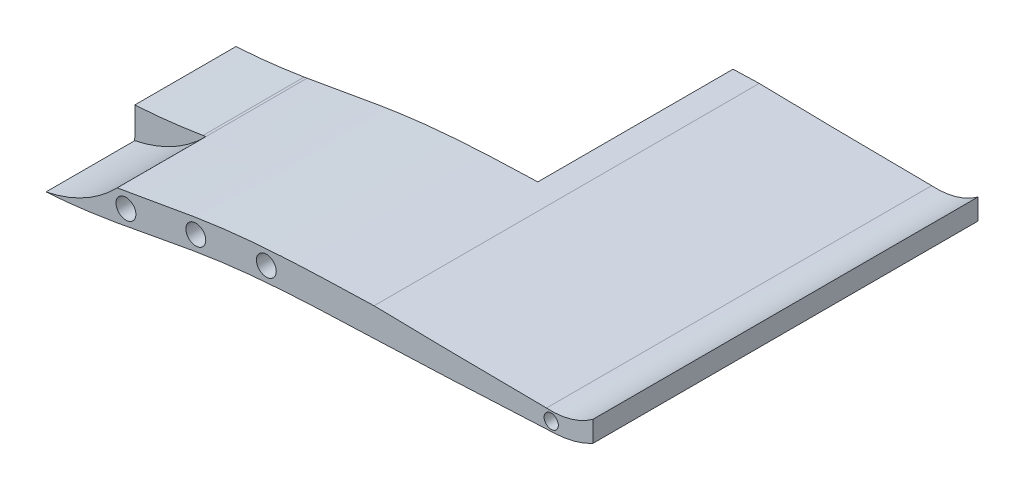
ISO-10303-21;
HEADER;
FILE_DESCRIPTION(('STEP AP214'),'2;1');
FILE_NAME('part.step','',(''),(''),'','','');
FILE_SCHEMA(('AUTOMOTIVE_DESIGN { 1 0 10303 214 1 1 1 1 }'));
ENDSEC;
DATA;
#1=APPLICATION_CONTEXT('core data for automotive mechanical design processes');
#2=APPLICATION_PROTOCOL_DEFINITION('international standard','automotive_design',2000,#1);
#3=PRODUCT_CONTEXT('',#1,'mechanical');
#4=PRODUCT('Part','Part','',(#3));
#5=PRODUCT_RELATED_PRODUCT_CATEGORY('part','',(#4));
#6=PRODUCT_DEFINITION_FORMATION('','',#4);
#7=PRODUCT_DEFINITION_CONTEXT('part definition',#1,'design');
#8=PRODUCT_DEFINITION('design','',#6,#7);
#9=PRODUCT_DEFINITION_SHAPE('','',#8);
#10=(LENGTH_UNIT() NAMED_UNIT(*) SI_UNIT(.MILLI.,.METRE.));
#11=(NAMED_UNIT(*) PLANE_ANGLE_UNIT() SI_UNIT($,.RADIAN.));
#12=(NAMED_UNIT(*) SI_UNIT($,.STERADIAN.) SOLID_ANGLE_UNIT());
#13=UNCERTAINTY_MEASURE_WITH_UNIT(LENGTH_MEASURE(1.E-05),#10,'distance_accuracy_value','');
#14=(GEOMETRIC_REPRESENTATION_CONTEXT(3) GLOBAL_UNCERTAINTY_ASSIGNED_CONTEXT((#13)) GLOBAL_UNIT_ASSIGNED_CONTEXT((#10,
#11,#12)) REPRESENTATION_CONTEXT('',''));
#15=CARTESIAN_POINT('',(0.,0.,0.));
#16=DIRECTION('',(0.,0.,1.));
#17=DIRECTION('',(1.,0.,0.));
#18=AXIS2_PLACEMENT_3D('',#15,#16,#17);
#19=CARTESIAN_POINT('',(87.5,6.60642753895215,103.5));
#20=DIRECTION('',(0.,0.,1.));
#21=DIRECTION('',(1.,0.,0.));
#22=AXIS2_PLACEMENT_3D('',#19,#20,#21);
#23=PLANE('',#22);
#24=CARTESIAN_POINT('',(150.,-22.5144995385756,103.5));
#25=DIRECTION('',(0.,0.,-1.));
#26=DIRECTION('',(1.,0.,0.));
#27=AXIS2_PLACEMENT_3D('',#24,#25,#26);
#28=CIRCLE('',#27,2.);
#29=CARTESIAN_POINT('',(152.,-22.5144995385756,103.5));
#30=VERTEX_POINT('',#29);
#31=EDGE_CURVE('E11',#30,#30,#28,.T.);
#32=ORIENTED_EDGE('',*,*,#31,.F.);
#33=EDGE_LOOP('',(#32));
#34=FACE_BOUND('',#33,.T.);
#35=ADVANCED_FACE('F17',(#34),#23,.T.);
#36=CARTESIAN_POINT('',(150.,-22.5144995385756,103.5));
#37=DIRECTION('',(0.,0.,1.));
#38=DIRECTION('',(1.,0.,0.));
#39=AXIS2_PLACEMENT_3D('',#36,#37,#38);
#40=CYLINDRICAL_SURFACE('',#39,2.);
#41=CARTESIAN_POINT('',(150.,-22.5144995385756,109.5));
#42=DIRECTION('',(0.,0.,-1.));
#43=DIRECTION('',(1.,0.,0.));
#44=AXIS2_PLACEMENT_3D('',#41,#42,#43);
#45=CIRCLE('',#44,2.);
#46=CARTESIAN_POINT('',(152.,-22.5144995385756,109.5));
#47=VERTEX_POINT('',#46);
#48=EDGE_CURVE('E261',#47,#47,#45,.T.);
#49=ORIENTED_EDGE('',*,*,#48,.F.);
#50=EDGE_LOOP('',(#49));
#51=FACE_BOUND('',#50,.T.);
#52=ORIENTED_EDGE('',*,*,#31,.T.);
#53=EDGE_LOOP('',(#52));
#54=FACE_BOUND('',#53,.T.);
#55=ADVANCED_FACE('F804',(#51,#54),#40,.F.);
#56=CARTESIAN_POINT('',(127.213429309531,-21.8806902767661,7.));
#57=DIRECTION('',(0.,0.,1.));
#58=DIRECTION('',(1.,0.,0.));
#59=AXIS2_PLACEMENT_3D('',#56,#57,#58);
#60=PLANE('',#59);
#61=CARTESIAN_POINT('',(127.364700461169,-22.9574489996217,7.));
#62=DIRECTION('',(0.,0.,1.));
#63=DIRECTION('',(1.,0.,0.));
#64=AXIS2_PLACEMENT_3D('',#61,#62,#63);
#65=CIRCLE('',#64,2.);
#66=CARTESIAN_POINT('',(129.364700461169,-22.9574489996217,7.));
#67=VERTEX_POINT('',#66);
#68=EDGE_CURVE('E27',#67,#67,#65,.T.);
#69=ORIENTED_EDGE('',*,*,#68,.F.);
#70=EDGE_LOOP('',(#69));
#71=FACE_BOUND('',#70,.T.);
#72=ADVANCED_FACE('F467',(#71),#60,.F.);
#73=CARTESIAN_POINT('',(127.364700461169,-22.9574489996217,7.));
#74=DIRECTION('',(0.,0.,-1.));
#75=DIRECTION('',(-1.,0.,0.));
#76=AXIS2_PLACEMENT_3D('',#73,#74,#75);
#77=CYLINDRICAL_SURFACE('',#76,2.);
#78=CARTESIAN_POINT('',(127.364700461169,-22.9574489996217,1.));
#79=DIRECTION('',(0.,0.,1.));
#80=DIRECTION('',(1.,0.,0.));
#81=AXIS2_PLACEMENT_3D('',#78,#79,#80);
#82=CIRCLE('',#81,2.);
#83=CARTESIAN_POINT('',(129.364700461169,-22.9574489996217,1.));
#84=VERTEX_POINT('',#83);
#85=EDGE_CURVE('E304',#84,#84,#82,.T.);
#86=ORIENTED_EDGE('',*,*,#85,.F.);
#87=EDGE_LOOP('',(#86));
#88=FACE_BOUND('',#87,.T.);
#89=ORIENTED_EDGE('',*,*,#68,.T.);
#90=EDGE_LOOP('',(#89));
#91=FACE_BOUND('',#90,.T.);
#92=ADVANCED_FACE('F757',(#88,#91),#77,.F.);
#93=CARTESIAN_POINT('',(127.213429309531,-21.8806902767661,9.));
#94=DIRECTION('',(0.,0.,1.));
#95=DIRECTION('',(1.,0.,0.));
#96=AXIS2_PLACEMENT_3D('',#93,#94,#95);
#97=PLANE('',#96);
#98=CARTESIAN_POINT('',(100.050572205956,-23.2932781091529,9.));
#99=DIRECTION('',(0.,0.,1.));
#100=DIRECTION('',(1.,0.,0.));
#101=AXIS2_PLACEMENT_3D('',#98,#99,#100);
#102=CIRCLE('',#101,2.8);
#103=CARTESIAN_POINT('',(102.850572205956,-23.2932781091529,9.));
#104=VERTEX_POINT('',#103);
#105=EDGE_CURVE('E313',#104,#104,#102,.T.);
#106=ORIENTED_EDGE('',*,*,#105,.F.);
#107=EDGE_LOOP('',(#106));
#108=FACE_BOUND('',#107,.T.);
#109=ADVANCED_FACE('F762',(#108),#97,.F.);
#110=CARTESIAN_POINT('',(100.050572205956,-23.2932781091529,9.));
#111=DIRECTION('',(0.,0.,-1.));
#112=DIRECTION('',(-1.,0.,0.));
#113=AXIS2_PLACEMENT_3D('',#110,#111,#112);
#114=CYLINDRICAL_SURFACE('',#113,2.8);
#115=CARTESIAN_POINT('',(100.050572205956,-23.2932781091529,1.));
#116=DIRECTION('',(0.,0.,1.));
#117=DIRECTION('',(1.,0.,0.));
#118=AXIS2_PLACEMENT_3D('',#115,#116,#117);
#119=CIRCLE('',#118,2.8);
#120=CARTESIAN_POINT('',(102.850572205956,-23.2932781091529,1.));
#121=VERTEX_POINT('',#120);
#122=EDGE_CURVE('E100',#121,#121,#119,.T.);
#123=ORIENTED_EDGE('',*,*,#122,.F.);
#124=EDGE_LOOP('',(#123));
#125=FACE_BOUND('',#124,.T.);
#126=ORIENTED_EDGE('',*,*,#105,.T.);
#127=EDGE_LOOP('',(#126));
#128=FACE_BOUND('',#127,.T.);
#129=ADVANCED_FACE('F799',(#125,#128),#114,.F.);
#130=CARTESIAN_POINT('',(161.720510257994,-19.1400105953305,109.502));
#131=DIRECTION('',(0.999996987172306,-0.00245471919193033,0.));
#132=DIRECTION('',(0.,0.,-1.));
#133=AXIS2_PLACEMENT_3D('',#130,#131,#132);
#134=PLANE('',#133);
#135=DIRECTION('',(-0.00245471919193033,-0.999996987172306,0.));
#136=VECTOR('',#135,1.);
#137=CARTESIAN_POINT('',(161.720510257994,-19.1400105953305,109.5));
#138=LINE('',#137,#136);
#139=CARTESIAN_POINT('',(161.727742285365,-16.1938464858363,109.5));
#140=VERTEX_POINT('',#139);
#141=CARTESIAN_POINT('',(161.713278230624,-22.0861747048248,109.5));
#142=VERTEX_POINT('',#141);
#143=EDGE_CURVE('E116',#140,#142,#138,.T.);
#144=ORIENTED_EDGE('',*,*,#143,.T.);
#145=DIRECTION('',(0.,0.,-1.));
#146=VECTOR('',#145,1.);
#147=CARTESIAN_POINT('',(161.713278230624,-22.0861747048248,109.502));
#148=LINE('',#147,#146);
#149=CARTESIAN_POINT('',(161.713278230624,-22.0861747048248,1.));
#150=VERTEX_POINT('',#149);
#151=EDGE_CURVE('E262',#142,#150,#148,.T.);
#152=ORIENTED_EDGE('',*,*,#151,.T.);
#153=DIRECTION('',(-0.00245471919193033,-0.999996987172306,0.));
#154=VECTOR('',#153,1.);
#155=CARTESIAN_POINT('',(161.720510257994,-19.1400105953305,1.));
#156=LINE('',#155,#154);
#157=CARTESIAN_POINT('',(161.727742285365,-16.1938464858363,1.));
#158=VERTEX_POINT('',#157);
#159=EDGE_CURVE('E271',#158,#150,#156,.T.);
#160=ORIENTED_EDGE('',*,*,#159,.F.);
#161=DIRECTION('',(0.,0.,-1.));
#162=VECTOR('',#161,1.);
#163=CARTESIAN_POINT('',(161.727742285365,-16.1938464858363,109.502));
#164=LINE('',#163,#162);
#165=EDGE_CURVE('E86',#140,#158,#164,.T.);
#166=ORIENTED_EDGE('',*,*,#165,.F.);
#167=EDGE_LOOP('',(#144,#152,#160,#166));
#168=FACE_BOUND('',#167,.T.);
#169=ADVANCED_FACE('F337',(#168),#134,.T.);
#170=CARTESIAN_POINT('',(68.25,0.,109.5));
#171=DIRECTION('',(0.,0.,1.));
#172=DIRECTION('',(1.,0.,0.));
#173=AXIS2_PLACEMENT_3D('',#170,#171,#172);
#174=PLANE('',#173);
#175=CARTESIAN_POINT('',(49.8787893659037,-27.0278823650516,109.5));
#176=DIRECTION('',(0.,0.,1.));
#177=DIRECTION('',(1.,0.,0.));
#178=AXIS2_PLACEMENT_3D('',#175,#176,#177);
#179=CIRCLE('',#178,2.8);
#180=CARTESIAN_POINT('',(52.6787893659037,-27.0278823650516,109.5));
#181=VERTEX_POINT('',#180);
#182=EDGE_CURVE('E300',#181,#181,#179,.T.);
#183=ORIENTED_EDGE('',*,*,#182,.F.);
#184=EDGE_LOOP('',(#183));
#185=FACE_BOUND('',#184,.T.);
#186=CARTESIAN_POINT('',(69.7406189530292,-24.6810279912166,109.5));
#187=DIRECTION('',(0.,0.,1.));
#188=DIRECTION('',(1.,0.,0.));
#189=AXIS2_PLACEMENT_3D('',#186,#187,#188);
#190=CIRCLE('',#189,2.8);
#191=CARTESIAN_POINT('',(72.5406189530292,-24.6810279912166,109.5));
#192=VERTEX_POINT('',#191);
#193=EDGE_CURVE('E291',#192,#192,#190,.T.);
#194=ORIENTED_EDGE('',*,*,#193,.F.);
#195=EDGE_LOOP('',(#194));
#196=FACE_BOUND('',#195,.T.);
#197=CARTESIAN_POINT('',(30.1945758013485,-30.5679016227643,109.5));
#198=DIRECTION('',(0.,0.,1.));
#199=DIRECTION('',(1.,0.,0.));
#200=AXIS2_PLACEMENT_3D('',#197,#198,#199);
#201=CIRCLE('',#200,2.8);
#202=CARTESIAN_POINT('',(32.9945758013485,-30.5679016227643,109.5));
#203=VERTEX_POINT('',#202);
#204=EDGE_CURVE('E285',#203,#203,#201,.T.);
#205=ORIENTED_EDGE('',*,*,#204,.F.);
#206=EDGE_LOOP('',(#205));
#207=FACE_BOUND('',#206,.T.);
#208=ORIENTED_EDGE('',*,*,#143,.F.);
#209=CARTESIAN_POINT('',(150.,-3.43475248243408E-13,109.5));
#210=DIRECTION('',(0.,0.,1.));
#211=DIRECTION('',(1.,0.,0.));
#212=AXIS2_PLACEMENT_3D('',#209,#210,#211);
#213=CIRCLE('',#212,19.9945143256538);
#214=CARTESIAN_POINT('',(148.675464404512,-19.9505941910292,109.5));
#215=VERTEX_POINT('',#214);
#216=EDGE_CURVE('E207',#215,#140,#213,.T.);
#217=ORIENTED_EDGE('',*,*,#216,.F.);
#218=CARTESIAN_POINT('',(100.10114440559,-19.2932781091448,109.5));
#219=CARTESIAN_POINT('',(112.702819243886,-19.5561619626584,109.5));
#220=CARTESIAN_POINT('',(125.861787303859,-19.8044851914799,109.5));
#221=CARTESIAN_POINT('',(148.67546441426,-19.9505941910916,109.5));
#222=(BOUNDED_CURVE() B_SPLINE_CURVE(3,(#218,#219,#220,#221),.UNSPECIFIED.,.F.,
.F.) B_SPLINE_CURVE_WITH_KNOTS((4,4),(0.69225639362224,0.988145722480666),
.UNSPECIFIED.) CURVE() GEOMETRIC_REPRESENTATION_ITEM() RATIONAL_B_SPLINE_CURVE((1.,1.,1.,1.)) REPRESENTATION_ITEM(''));
#223=CARTESIAN_POINT('',(100.10114440559,-19.2932781091448,109.5));
#224=VERTEX_POINT('',#223);
#225=EDGE_CURVE('E257',#224,#215,#222,.T.);
#226=ORIENTED_EDGE('',*,*,#225,.F.);
#227=CARTESIAN_POINT('',(27.7302875117602,-26.7073239864109,109.5));
#228=CARTESIAN_POINT('',(31.0488346102287,-26.1696366194871,109.5));
#229=CARTESIAN_POINT('',(37.5468164984674,-25.0075170846674,109.5));
#230=CARTESIAN_POINT('',(46.9891953367998,-23.2686587121111,109.5));
#231=CARTESIAN_POINT('',(56.2550049530886,-21.8368760200557,109.5));
#232=CARTESIAN_POINT('',(68.4649080136733,-20.5419300400245,109.5));
#233=CARTESIAN_POINT('',(80.3511557839398,-19.8990353634045,109.5));
#234=CARTESIAN_POINT('',(91.7995502359828,-19.5349714472918,109.5));
#235=CARTESIAN_POINT('',(97.3219852240696,-19.3758085303915,109.5));
#236=CARTESIAN_POINT('',(100.10114440559,-19.2932781091448,109.5));
#237=(BOUNDED_CURVE() B_SPLINE_CURVE(3,(#227,#228,#229,#230,#231,#232,#233,#234,#235,#236),
.UNSPECIFIED.,.F.,.F.) B_SPLINE_CURVE_WITH_KNOTS((4,1,1,1,1,1,1,4),(0.1700990687776,
0.23536873438318,0.30063839998876,0.36590806559434,0.43117773119992,0.56171706241108,
0.62698672801666,0.69225639362224),
.UNSPECIFIED.) CURVE() GEOMETRIC_REPRESENTATION_ITEM() RATIONAL_B_SPLINE_CURVE((1.,1.,1.,1.,1.,
1.,1.,1.,1.,1.)) REPRESENTATION_ITEM(''));
#238=CARTESIAN_POINT('',(27.7302875117602,-26.7073239864109,109.5));
#239=VERTEX_POINT('',#238);
#240=EDGE_CURVE('E198',#239,#224,#237,.T.);
#241=ORIENTED_EDGE('',*,*,#240,.F.);
#242=CARTESIAN_POINT('',(0.,0.,109.5));
#243=DIRECTION('',(0.,0.,1.));
#244=DIRECTION('',(1.,0.,0.));
#245=AXIS2_PLACEMENT_3D('',#242,#243,#244);
#246=CIRCLE('',#245,38.5);
#247=CARTESIAN_POINT('',(7.67441943357037,-37.7273546164799,109.5));
#248=VERTEX_POINT('',#247);
#249=EDGE_CURVE('E359',#248,#239,#246,.T.);
#250=ORIENTED_EDGE('',*,*,#249,.F.);
#251=CARTESIAN_POINT('',(83.6726727350818,-27.9374759907296,109.5));
#252=CARTESIAN_POINT('',(77.8982559482262,-28.2052321361078,109.5));
#253=CARTESIAN_POINT('',(69.0098767357283,-28.7413417578255,109.5));
#254=CARTESIAN_POINT('',(56.8409379042597,-30.0949749567846,109.5));
#255=CARTESIAN_POINT('',(47.6065011321946,-31.5633139890831,109.5));
#256=CARTESIAN_POINT('',(38.2089075406239,-33.3631870604971,109.5));
#257=CARTESIAN_POINT('',(25.2852975725938,-35.7985255608463,109.5));
#258=CARTESIAN_POINT('',(14.9776866774871,-37.2691885068536,109.5));
#259=CARTESIAN_POINT('',(7.67441943357037,-37.72735461648,109.5));
#260=(BOUNDED_CURVE() B_SPLINE_CURVE(3,(#251,#252,#253,#254,#255,#256,#257,#258,#259),
.UNSPECIFIED.,.F.,.F.) B_SPLINE_CURVE_WITH_KNOTS((4,1,1,1,1,1,4),(0.0447187594922693,
0.175081574587051,0.240262982134442,0.305444389681833,0.370625797229224,0.435807204776615,
0.566170019871397),
.UNSPECIFIED.) CURVE() GEOMETRIC_REPRESENTATION_ITEM() RATIONAL_B_SPLINE_CURVE((1.,1.,1.,1.,1.,
1.,1.,1.,1.)) REPRESENTATION_ITEM(''));
#261=CARTESIAN_POINT('',(83.6726727350818,-27.9374759907296,109.5));
#262=VERTEX_POINT('',#261);
#263=EDGE_CURVE('E437',#248,#262,#260,.F.);
#264=ORIENTED_EDGE('',*,*,#263,.T.);
#265=CARTESIAN_POINT('',(100.000000006321,-27.2932781091609,109.5));
#266=CARTESIAN_POINT('',(97.316358714667,-27.3942423768744,109.5));
#267=CARTESIAN_POINT('',(91.9854320234697,-27.5905886073946,109.5));
#268=CARTESIAN_POINT('',(86.4651687112206,-27.8079896744219,109.5));
#269=CARTESIAN_POINT('',(83.6726727350818,-27.9374759907295,109.5));
#270=(BOUNDED_CURVE() B_SPLINE_CURVE(3,(#265,#266,#267,#268,#269),.UNSPECIFIED.,.F.,
.F.) B_SPLINE_CURVE_WITH_KNOTS((4,1,4),(0.566170019871397,0.629213206746819,0.69225639362224),
.UNSPECIFIED.) CURVE() GEOMETRIC_REPRESENTATION_ITEM() RATIONAL_B_SPLINE_CURVE((1.,1.,1.,1.,1.)) REPRESENTATION_ITEM(''));
#271=CARTESIAN_POINT('',(100.000000006321,-27.2932781091609,109.5));
#272=VERTEX_POINT('',#271);
#273=EDGE_CURVE('E321',#262,#272,#270,.F.);
#274=ORIENTED_EDGE('',*,*,#273,.T.);
#275=CARTESIAN_POINT('',(100.000000006321,-27.2932781091609,109.5));
#276=CARTESIAN_POINT('',(113.100122164643,-26.8004237754669,109.5));
#277=CARTESIAN_POINT('',(126.801135733652,-26.2566221801135,109.5));
#278=CARTESIAN_POINT('',(151.315014110715,-24.9653908018405,109.5));
#279=(BOUNDED_CURVE() B_SPLINE_CURVE(3,(#275,#276,#277,#278),.UNSPECIFIED.,.F.,
.F.) B_SPLINE_CURVE_WITH_KNOTS((4,4),(0.69225639362224,1.),
.UNSPECIFIED.) CURVE() GEOMETRIC_REPRESENTATION_ITEM() RATIONAL_B_SPLINE_CURVE((1.,1.,1.,1.)) REPRESENTATION_ITEM(''));
#280=CARTESIAN_POINT('',(151.315014110715,-24.9653908018405,109.5));
#281=VERTEX_POINT('',#280);
#282=EDGE_CURVE('E239',#272,#281,#279,.T.);
#283=ORIENTED_EDGE('',*,*,#282,.T.);
#284=CARTESIAN_POINT('',(150.,-9.81853487402873E-13,109.5));
#285=DIRECTION('',(0.,0.,1.));
#286=DIRECTION('',(1.,0.,0.));
#287=AXIS2_PLACEMENT_3D('',#284,#285,#286);
#288=CIRCLE('',#287,25.);
#289=EDGE_CURVE('E258',#281,#142,#288,.T.);
#290=ORIENTED_EDGE('',*,*,#289,.T.);
#291=EDGE_LOOP('',(#208,#217,#226,#241,#250,#264,#274,#283,#290));
#292=FACE_BOUND('',#291,.T.);
#293=ORIENTED_EDGE('',*,*,#48,.T.);
#294=EDGE_LOOP('',(#293));
#295=FACE_BOUND('',#294,.T.);
#296=ADVANCED_FACE('F327',(#185,#196,#207,#292,#295),#174,.T.);
#297=CARTESIAN_POINT('',(150.,-9.81853487402873E-13,3.));
#298=DIRECTION('',(0.,0.,-1.));
#299=DIRECTION('',(-1.,0.,0.));
#300=AXIS2_PLACEMENT_3D('',#297,#298,#299);
#301=CYLINDRICAL_SURFACE('',#300,25.);
#302=ORIENTED_EDGE('',*,*,#151,.F.);
#303=ORIENTED_EDGE('',*,*,#289,.F.);
#304=DIRECTION('',(0.,0.,-1.));
#305=VECTOR('',#304,1.);
#306=CARTESIAN_POINT('',(151.315014110715,-24.9653908018405,3.));
#307=LINE('',#306,#305);
#308=CARTESIAN_POINT('',(151.315014110715,-24.9653908018415,1.));
#309=VERTEX_POINT('',#308);
#310=EDGE_CURVE('E237',#281,#309,#307,.T.);
#311=ORIENTED_EDGE('',*,*,#310,.T.);
#312=CARTESIAN_POINT('',(150.,-9.81853487402873E-13,1.));
#313=DIRECTION('',(0.,0.,1.));
#314=DIRECTION('',(1.,0.,0.));
#315=AXIS2_PLACEMENT_3D('',#312,#313,#314);
#316=CIRCLE('',#315,25.);
#317=EDGE_CURVE('E267',#309,#150,#316,.T.);
#318=ORIENTED_EDGE('',*,*,#317,.T.);
#319=EDGE_LOOP('',(#302,#303,#311,#318));
#320=FACE_BOUND('',#319,.T.);
#321=ADVANCED_FACE('F336',(#320),#301,.T.);
#322=CARTESIAN_POINT('',(150.,-3.43475248243408E-13,84.5));
#323=DIRECTION('',(0.,0.,-1.));
#324=DIRECTION('',(-1.,0.,0.));
#325=AXIS2_PLACEMENT_3D('',#322,#323,#324);
#326=CYLINDRICAL_SURFACE('',#325,19.9945143256538);
#327=ORIENTED_EDGE('',*,*,#216,.T.);
#328=ORIENTED_EDGE('',*,*,#165,.T.);
#329=CARTESIAN_POINT('',(150.,-3.43475248243408E-13,1.));
#330=DIRECTION('',(0.,0.,1.));
#331=DIRECTION('',(1.,0.,0.));
#332=AXIS2_PLACEMENT_3D('',#329,#330,#331);
#333=CIRCLE('',#332,19.9945143256538);
#334=CARTESIAN_POINT('',(148.67546441426,-19.9505941910916,1.));
#335=VERTEX_POINT('',#334);
#336=EDGE_CURVE('E303',#335,#158,#333,.T.);
#337=ORIENTED_EDGE('',*,*,#336,.F.);
#338=DIRECTION('',(0.,0.,-1.));
#339=VECTOR('',#338,1.);
#340=CARTESIAN_POINT('',(148.675464404512,-19.9505941910292,84.5));
#341=LINE('',#340,#339);
#342=EDGE_CURVE('E249',#215,#335,#341,.T.);
#343=ORIENTED_EDGE('',*,*,#342,.F.);
#344=EDGE_LOOP('',(#327,#328,#337,#343));
#345=FACE_BOUND('',#344,.T.);
#346=ADVANCED_FACE('F595',(#345),#326,.F.);
#347=CARTESIAN_POINT('',(162.738791029295,-11.6940658797393,1.));
#348=DIRECTION('',(0.,0.,1.));
#349=DIRECTION('',(1.,0.,0.));
#350=AXIS2_PLACEMENT_3D('',#347,#348,#349);
#351=PLANE('',#350);
#352=ORIENTED_EDGE('',*,*,#336,.T.);
#353=ORIENTED_EDGE('',*,*,#159,.T.);
#354=ORIENTED_EDGE('',*,*,#317,.F.);
#355=CARTESIAN_POINT('',(100.000000006321,-27.2932781091609,1.));
#356=CARTESIAN_POINT('',(113.100122164643,-26.8004237754669,1.));
#357=CARTESIAN_POINT('',(126.801135733652,-26.2566221801135,1.));
#358=CARTESIAN_POINT('',(151.315014110715,-24.9653908018405,1.));
#359=(BOUNDED_CURVE() B_SPLINE_CURVE(3,(#355,#356,#357,#358),.UNSPECIFIED.,.F.,
.F.) B_SPLINE_CURVE_WITH_KNOTS((4,4),(0.69225639362224,1.),
.UNSPECIFIED.) CURVE() GEOMETRIC_REPRESENTATION_ITEM() RATIONAL_B_SPLINE_CURVE((1.,1.,1.,1.)) REPRESENTATION_ITEM(''));
#360=CARTESIAN_POINT('',(100.000000006321,-27.2932781091609,1.));
#361=VERTEX_POINT('',#360);
#362=EDGE_CURVE('E240',#361,#309,#359,.T.);
#363=ORIENTED_EDGE('',*,*,#362,.F.);
#364=CARTESIAN_POINT('',(83.6726727350818,-27.9374759907295,1.));
#365=CARTESIAN_POINT('',(86.4651687112206,-27.8079896744219,1.));
#366=CARTESIAN_POINT('',(91.9854320234697,-27.5905886073946,1.00000000000003));
#367=CARTESIAN_POINT('',(97.316358714667,-27.3942423768744,1.));
#368=CARTESIAN_POINT('',(100.000000006321,-27.2932781091609,1.));
#369=(BOUNDED_CURVE() B_SPLINE_CURVE(3,(#364,#365,#366,#367,#368),.UNSPECIFIED.,.F.,
.F.) B_SPLINE_CURVE_WITH_KNOTS((4,1,4),(0.566170019871397,0.629213206746818,0.69225639362224),
.UNSPECIFIED.) CURVE() GEOMETRIC_REPRESENTATION_ITEM() RATIONAL_B_SPLINE_CURVE((1.,1.,1.,1.,1.)) REPRESENTATION_ITEM(''));
#370=CARTESIAN_POINT('',(92.6996163336856,-27.5670340676965,1.));
#371=VERTEX_POINT('',#370);
#372=EDGE_CURVE('E632',#371,#361,#369,.T.);
#373=ORIENTED_EDGE('',*,*,#372,.F.);
#374=DIRECTION('',(0.00245471919193063,0.999996987172306,0.));
#375=VECTOR('',#374,1.);
#376=CARTESIAN_POINT('',(92.7390019272332,-11.5222355363042,1.));
#377=LINE('',#376,#375);
#378=CARTESIAN_POINT('',(92.7193902280796,-19.5115974687914,1.));
#379=VERTEX_POINT('',#378);
#380=EDGE_CURVE('E602',#371,#379,#377,.T.);
#381=ORIENTED_EDGE('',*,*,#380,.T.);
#382=CARTESIAN_POINT('',(100.10114440559,-19.2932781091448,1.));
#383=CARTESIAN_POINT('',(97.3219852240696,-19.3758085303915,1.));
#384=CARTESIAN_POINT('',(91.7995502359828,-19.5349714472918,1.00000000000004));
#385=CARTESIAN_POINT('',(80.3511557839398,-19.8990353634045,1.00000000000004));
#386=CARTESIAN_POINT('',(68.4649080136733,-20.5419300400245,1.00000000000007));
#387=CARTESIAN_POINT('',(56.2550049530886,-21.8368760200557,0.999999999999973));
#388=CARTESIAN_POINT('',(46.9891953367998,-23.2686587121111,1.00000000000003));
#389=CARTESIAN_POINT('',(37.5468164984674,-25.0075170846674,0.999999999999959));
#390=CARTESIAN_POINT('',(31.0488346102287,-26.1696366194871,1.00000000000003));
#391=CARTESIAN_POINT('',(27.7302875117602,-26.7073239864109,1.));
#392=(BOUNDED_CURVE() B_SPLINE_CURVE(3,(#382,#383,#384,#385,#386,#387,#388,#389,#390,#391),
.UNSPECIFIED.,.F.,.F.) B_SPLINE_CURVE_WITH_KNOTS((4,1,1,1,1,1,1,4),(0.1700990687776,
0.23536873438318,0.30063839998876,0.43117773119992,0.4964473968055,0.56171706241108,
0.62698672801666,0.69225639362224),
.UNSPECIFIED.) CURVE() GEOMETRIC_REPRESENTATION_ITEM() RATIONAL_B_SPLINE_CURVE((1.,1.,1.,1.,1.,
1.,1.,1.,1.,1.)) REPRESENTATION_ITEM(''));
#393=CARTESIAN_POINT('',(100.10114440559,-19.2932781091448,1.));
#394=VERTEX_POINT('',#393);
#395=EDGE_CURVE('E256',#379,#394,#392,.F.);
#396=ORIENTED_EDGE('',*,*,#395,.T.);
#397=CARTESIAN_POINT('',(100.10114440559,-19.2932781091448,1.));
#398=CARTESIAN_POINT('',(112.702819243886,-19.5561619626584,1.));
#399=CARTESIAN_POINT('',(125.861787303859,-19.8044851914799,1.));
#400=CARTESIAN_POINT('',(148.67546441426,-19.9505941910916,1.));
#401=(BOUNDED_CURVE() B_SPLINE_CURVE(3,(#397,#398,#399,#400),.UNSPECIFIED.,.F.,
.F.) B_SPLINE_CURVE_WITH_KNOTS((4,4),(0.69225639362224,0.988145722480666),
.UNSPECIFIED.) CURVE() GEOMETRIC_REPRESENTATION_ITEM() RATIONAL_B_SPLINE_CURVE((1.,1.,1.,1.)) REPRESENTATION_ITEM(''));
#402=EDGE_CURVE('E358',#394,#335,#401,.T.);
#403=ORIENTED_EDGE('',*,*,#402,.T.);
#404=EDGE_LOOP('',(#352,#353,#354,#363,#373,#381,#396,#403));
#405=FACE_BOUND('',#404,.T.);
#406=ORIENTED_EDGE('',*,*,#122,.T.);
#407=EDGE_LOOP('',(#406));
#408=FACE_BOUND('',#407,.T.);
#409=ORIENTED_EDGE('',*,*,#85,.T.);
#410=EDGE_LOOP('',(#409));
#411=FACE_BOUND('',#410,.T.);
#412=ADVANCED_FACE('F512',(#405,#408,#411),#351,.F.);
#413=CARTESIAN_POINT('',(100.000000006321,-27.2932781091609,109.5));
#414=CARTESIAN_POINT('',(100.000000006321,-27.2932781091609,1.));
#415=CARTESIAN_POINT('',(113.100122164643,-26.800423775467,109.5));
#416=CARTESIAN_POINT('',(113.100122164643,-26.800423775467,1.));
#417=CARTESIAN_POINT('',(126.801135733652,-26.2566221801135,109.5));
#418=CARTESIAN_POINT('',(126.801135733652,-26.2566221801135,1.));
#419=CARTESIAN_POINT('',(151.315014110715,-24.9653908018405,109.5));
#420=CARTESIAN_POINT('',(151.315014110715,-24.9653908018405,1.));
#421=(BOUNDED_SURFACE() B_SPLINE_SURFACE(3,1,((#413,#414),(#415,#416),(#417,#418),(#419,#420)),
.UNSPECIFIED.,.F.,.F.,.F.) B_SPLINE_SURFACE_WITH_KNOTS((4,4),(2,2),(0.69225639362224,1.),(0.,
1.),.UNSPECIFIED.) GEOMETRIC_REPRESENTATION_ITEM() RATIONAL_B_SPLINE_SURFACE(((1.,1.),(1.,1.),
(1.,1.),(1.,1.))) REPRESENTATION_ITEM('') SURFACE());
#422=DIRECTION('',(0.,0.,-1.));
#423=VECTOR('',#422,1.);
#424=CARTESIAN_POINT('',(100.000000006321,-27.2932781091609,3.));
#425=LINE('',#424,#423);
#426=EDGE_CURVE('E626',#272,#361,#425,.T.);
#427=ORIENTED_EDGE('',*,*,#426,.T.);
#428=ORIENTED_EDGE('',*,*,#362,.T.);
#429=ORIENTED_EDGE('',*,*,#310,.F.);
#430=ORIENTED_EDGE('',*,*,#282,.F.);
#431=EDGE_LOOP('',(#427,#428,#429,#430));
#432=FACE_BOUND('',#431,.T.);
#433=ADVANCED_FACE('F653',(#432),#421,.F.);
#434=CARTESIAN_POINT('',(83.6726727350818,-27.9374759907295,109.5));
#435=CARTESIAN_POINT('',(83.6726727350818,-27.9374759907295,1.));
#436=CARTESIAN_POINT('',(86.4651687112206,-27.8079896744219,109.5));
#437=CARTESIAN_POINT('',(86.4651687112206,-27.8079896744219,1.));
#438=CARTESIAN_POINT('',(91.9854320234697,-27.5905886073946,109.5));
#439=CARTESIAN_POINT('',(91.9854320234697,-27.5905886073946,1.00000000000003));
#440=CARTESIAN_POINT('',(97.316358714667,-27.3942423768744,109.5));
#441=CARTESIAN_POINT('',(97.316358714667,-27.3942423768744,1.));
#442=CARTESIAN_POINT('',(100.000000006321,-27.2932781091609,109.5));
#443=CARTESIAN_POINT('',(100.000000006321,-27.2932781091609,1.));
#444=(BOUNDED_SURFACE() B_SPLINE_SURFACE(3,1,((#434,#435),(#436,#437),(#438,#439),(#440,#441),
(#442,#443)),.UNSPECIFIED.,.F.,.F.,.F.) B_SPLINE_SURFACE_WITH_KNOTS((4,1,4),(2,2),
(0.566170019871397,0.629213206746818,0.69225639362224),(0.,1.),
.UNSPECIFIED.) GEOMETRIC_REPRESENTATION_ITEM() RATIONAL_B_SPLINE_SURFACE(((1.,1.),(1.,1.),(1.,
1.),(1.,1.),(1.,1.))) REPRESENTATION_ITEM('') SURFACE());
#445=CARTESIAN_POINT('',(92.6996113641812,-27.5669029722868,109.5));
#446=CARTESIAN_POINT('',(92.6996113641812,-27.5669029722868,1.00000000000001));
#447=(BOUNDED_CURVE() B_SPLINE_CURVE(1,(#445,#446),.UNSPECIFIED.,.F.,
.F.) B_SPLINE_CURVE_WITH_KNOTS((2,2),(0.,1.),
.UNSPECIFIED.) CURVE() GEOMETRIC_REPRESENTATION_ITEM() RATIONAL_B_SPLINE_CURVE((1.,1.)) REPRESENTATION_ITEM(''));
#448=CARTESIAN_POINT('',(92.6996163336856,-27.5670340676965,56.));
#449=VERTEX_POINT('',#448);
#450=EDGE_CURVE('E166',#371,#449,#447,.F.);
#451=DIRECTION('',(0.,0.,-1.));
#452=VECTOR('',#451,1.);
#453=CARTESIAN_POINT('',(83.6726727350818,-27.9374759907296,53.));
#454=LINE('',#453,#452);
#455=CARTESIAN_POINT('',(83.6726727350818,-27.9374759907296,56.));
#456=VERTEX_POINT('',#455);
#457=EDGE_CURVE('E290',#262,#456,#454,.T.);
#458=CARTESIAN_POINT('',(83.6726727350818,-27.9374759907295,56.));
#459=CARTESIAN_POINT('',(86.4651687112206,-27.8079896744219,56.));
#460=CARTESIAN_POINT('',(91.9854320234697,-27.5905886073946,56.));
#461=CARTESIAN_POINT('',(97.316358714667,-27.3942423768744,56.));
#462=CARTESIAN_POINT('',(100.000000006321,-27.2932781091609,56.));
#463=(BOUNDED_CURVE() B_SPLINE_CURVE(3,(#458,#459,#460,#461,#462),.UNSPECIFIED.,.F.,
.F.) B_SPLINE_CURVE_WITH_KNOTS((4,1,4),(0.566170019871397,0.629213206746818,0.69225639362224),
.UNSPECIFIED.) CURVE() GEOMETRIC_REPRESENTATION_ITEM() RATIONAL_B_SPLINE_CURVE((1.,1.,1.,1.,1.)) REPRESENTATION_ITEM(''));
#464=EDGE_CURVE('E582',#456,#449,#463,.T.);
#465=ORIENTED_EDGE('',*,*,#450,.F.);
#466=ORIENTED_EDGE('',*,*,#372,.T.);
#467=ORIENTED_EDGE('',*,*,#426,.F.);
#468=ORIENTED_EDGE('',*,*,#273,.F.);
#469=ORIENTED_EDGE('',*,*,#457,.T.);
#470=ORIENTED_EDGE('',*,*,#464,.T.);
#471=EDGE_LOOP('',(#465,#466,#467,#468,#469,#470));
#472=FACE_BOUND('',#471,.T.);
#473=ADVANCED_FACE('F642',(#472),#444,.F.);
#474=CARTESIAN_POINT('',(92.7054505223208,-25.1903177911386,69.75));
#475=DIRECTION('',(-0.999996987172306,0.00245471919193063,0.));
#476=DIRECTION('',(0.,0.,1.));
#477=AXIS2_PLACEMENT_3D('',#474,#475,#476);
#478=PLANE('',#477);
#479=ORIENTED_EDGE('',*,*,#380,.F.);
#480=ORIENTED_EDGE('',*,*,#450,.T.);
#481=DIRECTION('',(0.00245471919193063,0.999996987172306,0.));
#482=VECTOR('',#481,1.);
#483=CARTESIAN_POINT('',(92.7161669428452,-20.8246908498207,56.));
#484=LINE('',#483,#482);
#485=CARTESIAN_POINT('',(92.7193902280796,-19.5115974687914,56.));
#486=VERTEX_POINT('',#485);
#487=EDGE_CURVE('E670',#449,#486,#484,.T.);
#488=ORIENTED_EDGE('',*,*,#487,.T.);
#489=CARTESIAN_POINT('',(92.7193845918399,-19.5114097455236,1.00000000000003));
#490=CARTESIAN_POINT('',(92.7193845918399,-19.5114097455236,109.5));
#491=(BOUNDED_CURVE() B_SPLINE_CURVE(1,(#489,#490),.UNSPECIFIED.,.F.,
.F.) B_SPLINE_CURVE_WITH_KNOTS((2,2),(0.,1.),
.UNSPECIFIED.) CURVE() GEOMETRIC_REPRESENTATION_ITEM() RATIONAL_B_SPLINE_CURVE((1.,1.)) REPRESENTATION_ITEM(''));
#492=EDGE_CURVE('E179',#379,#486,#491,.T.);
#493=ORIENTED_EDGE('',*,*,#492,.F.);
#494=EDGE_LOOP('',(#479,#480,#488,#493));
#495=FACE_BOUND('',#494,.T.);
#496=ADVANCED_FACE('F400',(#495),#478,.T.);
#497=CARTESIAN_POINT('',(27.7302875117602,-26.7073239864109,109.5));
#498=CARTESIAN_POINT('',(27.7302875117602,-26.7073239864109,1.));
#499=CARTESIAN_POINT('',(31.0488346102287,-26.1696366194871,109.5));
#500=CARTESIAN_POINT('',(31.0488346102287,-26.1696366194871,1.00000000000003));
#501=CARTESIAN_POINT('',(37.5468164984674,-25.0075170846674,109.5));
#502=CARTESIAN_POINT('',(37.5468164984674,-25.0075170846674,0.999999999999959));
#503=CARTESIAN_POINT('',(46.9891953367998,-23.2686587121111,109.5));
#504=CARTESIAN_POINT('',(46.9891953367998,-23.2686587121111,1.00000000000003));
#505=CARTESIAN_POINT('',(56.2550049530886,-21.8368760200557,109.5));
#506=CARTESIAN_POINT('',(56.2550049530886,-21.8368760200557,0.999999999999973));
#507=CARTESIAN_POINT('',(68.4649080136733,-20.5419300400245,109.5));
#508=CARTESIAN_POINT('',(68.4649080136733,-20.5419300400245,1.00000000000007));
#509=CARTESIAN_POINT('',(80.3511557839398,-19.8990353634045,109.5));
#510=CARTESIAN_POINT('',(80.3511557839398,-19.8990353634045,1.00000000000004));
#511=CARTESIAN_POINT('',(91.7995502359828,-19.5349714472918,109.5));
#512=CARTESIAN_POINT('',(91.7995502359828,-19.5349714472918,1.00000000000004));
#513=CARTESIAN_POINT('',(97.3219852240696,-19.3758085303915,109.5));
#514=CARTESIAN_POINT('',(97.3219852240696,-19.3758085303915,1.));
#515=CARTESIAN_POINT('',(100.10114440559,-19.2932781091448,109.5));
#516=CARTESIAN_POINT('',(100.10114440559,-19.2932781091448,1.));
#517=(BOUNDED_SURFACE() B_SPLINE_SURFACE(3,1,((#497,#498),(#499,#500),(#501,#502),(#503,#504),
(#505,#506),(#507,#508),(#509,#510),(#511,#512),(#513,#514),(#515,#516)),.UNSPECIFIED.,.F.,.F.,
.F.) B_SPLINE_SURFACE_WITH_KNOTS((4,1,1,1,1,1,1,4),(2,2),(0.1700990687776,0.23536873438318,
0.30063839998876,0.36590806559434,0.43117773119992,0.56171706241108,0.62698672801666,
0.69225639362224),(0.,1.),
.UNSPECIFIED.) GEOMETRIC_REPRESENTATION_ITEM() RATIONAL_B_SPLINE_SURFACE(((1.,1.),(1.,1.),(1.,
1.),(1.,1.),(1.,1.),(1.,1.),(1.,1.),(1.,1.),(1.,1.),(1.,1.))) REPRESENTATION_ITEM('') SURFACE());
#518=CARTESIAN_POINT('',(100.10114440559,-19.2932781091448,56.));
#519=CARTESIAN_POINT('',(97.3219852240696,-19.3758085303915,56.));
#520=CARTESIAN_POINT('',(91.7995502359828,-19.5349714472918,56.));
#521=CARTESIAN_POINT('',(80.3511557839398,-19.8990353634045,56.));
#522=CARTESIAN_POINT('',(68.4649080136733,-20.5419300400245,56.));
#523=CARTESIAN_POINT('',(56.2550049530886,-21.8368760200557,55.9999999999999));
#524=CARTESIAN_POINT('',(46.9891953367998,-23.2686587121111,56.));
#525=CARTESIAN_POINT('',(37.5468164984674,-25.0075170846674,55.9999999999999));
#526=CARTESIAN_POINT('',(31.0488346102287,-26.1696366194871,56.));
#527=CARTESIAN_POINT('',(27.7302875117602,-26.7073239864109,56.));
#528=(BOUNDED_CURVE() B_SPLINE_CURVE(3,(#518,#519,#520,#521,#522,#523,#524,#525,#526,#527),
.UNSPECIFIED.,.F.,.F.) B_SPLINE_CURVE_WITH_KNOTS((4,1,1,1,1,1,1,4),(0.1700990687776,
0.23536873438318,0.30063839998876,0.43117773119992,0.4964473968055,0.56171706241108,
0.62698672801666,0.69225639362224),
.UNSPECIFIED.) CURVE() GEOMETRIC_REPRESENTATION_ITEM() RATIONAL_B_SPLINE_CURVE((1.,1.,1.,1.,1.,
1.,1.,1.,1.,1.)) REPRESENTATION_ITEM(''));
#529=CARTESIAN_POINT('',(27.7302875117602,-26.7073239864109,56.));
#530=VERTEX_POINT('',#529);
#531=EDGE_CURVE('E533',#530,#486,#528,.F.);
#532=DIRECTION('',(0.,0.,-1.));
#533=VECTOR('',#532,1.);
#534=CARTESIAN_POINT('',(27.7302875117602,-26.7073239864109,84.5));
#535=LINE('',#534,#533);
#536=CARTESIAN_POINT('',(27.7302875117602,-26.7073239864109,84.5));
#537=VERTEX_POINT('',#536);
#538=EDGE_CURVE('E538',#537,#530,#535,.T.);
#539=DIRECTION('',(0.,0.,-1.));
#540=VECTOR('',#539,1.);
#541=CARTESIAN_POINT('',(27.7302875117602,-26.7073239864109,109.5));
#542=LINE('',#541,#540);
#543=EDGE_CURVE('E350',#239,#537,#542,.T.);
#544=DIRECTION('',(0.,0.,-1.));
#545=VECTOR('',#544,1.);
#546=CARTESIAN_POINT('',(100.10114440559,-19.2932781091448,84.5));
#547=LINE('',#546,#545);
#548=EDGE_CURVE('E371',#224,#394,#547,.T.);
#549=ORIENTED_EDGE('',*,*,#395,.F.);
#550=ORIENTED_EDGE('',*,*,#492,.T.);
#551=ORIENTED_EDGE('',*,*,#531,.F.);
#552=ORIENTED_EDGE('',*,*,#538,.F.);
#553=ORIENTED_EDGE('',*,*,#543,.F.);
#554=ORIENTED_EDGE('',*,*,#240,.T.);
#555=ORIENTED_EDGE('',*,*,#548,.T.);
#556=EDGE_LOOP('',(#549,#550,#551,#552,#553,#554,#555));
#557=FACE_BOUND('',#556,.T.);
#558=ADVANCED_FACE('F388',(#557),#517,.T.);
#559=CARTESIAN_POINT('',(100.10114440559,-19.2932781091448,109.5));
#560=CARTESIAN_POINT('',(100.10114440559,-19.2932781091448,1.));
#561=CARTESIAN_POINT('',(112.702819243886,-19.5561619626584,109.5));
#562=CARTESIAN_POINT('',(112.702819243886,-19.5561619626584,1.00000000000003));
#563=CARTESIAN_POINT('',(125.861787303859,-19.8044851914799,109.5));
#564=CARTESIAN_POINT('',(125.861787303859,-19.8044851914799,1.00000000000003));
#565=CARTESIAN_POINT('',(148.67546441426,-19.9505941910916,109.5));
#566=CARTESIAN_POINT('',(148.67546441426,-19.9505941910916,1.));
#567=(BOUNDED_SURFACE() B_SPLINE_SURFACE(3,1,((#559,#560),(#561,#562),(#563,#564),(#565,#566)),
.UNSPECIFIED.,.F.,.F.,.F.) B_SPLINE_SURFACE_WITH_KNOTS((4,4),(2,2),(0.69225639362224,
0.988145722480666),(0.,1.),
.UNSPECIFIED.) GEOMETRIC_REPRESENTATION_ITEM() RATIONAL_B_SPLINE_SURFACE(((1.,1.),(1.,1.),(1.,
1.),(1.,1.))) REPRESENTATION_ITEM('') SURFACE());
#568=ORIENTED_EDGE('',*,*,#402,.F.);
#569=ORIENTED_EDGE('',*,*,#548,.F.);
#570=ORIENTED_EDGE('',*,*,#225,.T.);
#571=ORIENTED_EDGE('',*,*,#342,.T.);
#572=EDGE_LOOP('',(#568,#569,#570,#571));
#573=FACE_BOUND('',#572,.T.);
#574=ADVANCED_FACE('F399',(#573),#567,.T.);
#575=CARTESIAN_POINT('',(0.,0.,109.5));
#576=DIRECTION('',(0.,0.,-1.));
#577=DIRECTION('',(-1.,0.,0.));
#578=AXIS2_PLACEMENT_3D('',#575,#576,#577);
#579=CYLINDRICAL_SURFACE('',#578,38.5);
#580=CARTESIAN_POINT('',(0.,0.,84.5));
#581=DIRECTION('',(0.,0.,1.));
#582=DIRECTION('',(1.,0.,0.));
#583=AXIS2_PLACEMENT_3D('',#580,#581,#582);
#584=CIRCLE('',#583,38.5);
#585=CARTESIAN_POINT('',(7.67441943357037,-37.7273546164799,84.5));
#586=VERTEX_POINT('',#585);
#587=EDGE_CURVE('E276',#586,#537,#584,.T.);
#588=ORIENTED_EDGE('',*,*,#587,.F.);
#589=DIRECTION('',(0.,0.,-1.));
#590=VECTOR('',#589,1.);
#591=CARTESIAN_POINT('',(7.67441943357037,-37.7273546164799,109.5));
#592=LINE('',#591,#590);
#593=EDGE_CURVE('E365',#248,#586,#592,.T.);
#594=ORIENTED_EDGE('',*,*,#593,.F.);
#595=ORIENTED_EDGE('',*,*,#249,.T.);
#596=ORIENTED_EDGE('',*,*,#543,.T.);
#597=EDGE_LOOP('',(#588,#594,#595,#596));
#598=FACE_BOUND('',#597,.T.);
#599=ADVANCED_FACE('F466',(#598),#579,.F.);
#600=CARTESIAN_POINT('',(7.67441943357037,-37.72735461648,109.5));
#601=CARTESIAN_POINT('',(7.67441943357037,-37.72735461648,56.));
#602=CARTESIAN_POINT('',(14.9776866774871,-37.2691885068536,109.5));
#603=CARTESIAN_POINT('',(14.9776866774871,-37.2691885068536,56.));
#604=CARTESIAN_POINT('',(25.2852975725938,-35.7985255608463,109.5));
#605=CARTESIAN_POINT('',(25.2852975725938,-35.7985255608463,56.));
#606=CARTESIAN_POINT('',(38.2089075406239,-33.3631870604971,109.5));
#607=CARTESIAN_POINT('',(38.2089075406239,-33.3631870604971,56.));
#608=CARTESIAN_POINT('',(47.6065011321946,-31.5633139890831,109.5));
#609=CARTESIAN_POINT('',(47.6065011321946,-31.5633139890831,56.));
#610=CARTESIAN_POINT('',(56.8409379042597,-30.0949749567846,109.5));
#611=CARTESIAN_POINT('',(56.8409379042597,-30.0949749567846,56.));
#612=CARTESIAN_POINT('',(69.0098767357283,-28.7413417578255,109.5));
#613=CARTESIAN_POINT('',(69.0098767357283,-28.7413417578255,56.));
#614=CARTESIAN_POINT('',(77.8982559482262,-28.2052321361078,109.5));
#615=CARTESIAN_POINT('',(77.8982559482262,-28.2052321361078,56.));
#616=CARTESIAN_POINT('',(83.6726727350818,-27.9374759907296,109.5));
#617=CARTESIAN_POINT('',(83.6726727350818,-27.9374759907296,56.));
#618=(BOUNDED_SURFACE() B_SPLINE_SURFACE(3,1,((#600,#601),(#602,#603),(#604,#605),(#606,#607),
(#608,#609),(#610,#611),(#612,#613),(#614,#615),(#616,#617)),.UNSPECIFIED.,.F.,.F.,
.F.) B_SPLINE_SURFACE_WITH_KNOTS((4,1,1,1,1,1,4),(2,2),(0.0447187594922693,0.175081574587051,
0.240262982134442,0.305444389681833,0.370625797229224,0.435807204776615,0.566170019871397),(0.,
1.),.UNSPECIFIED.) GEOMETRIC_REPRESENTATION_ITEM() RATIONAL_B_SPLINE_SURFACE(((1.,1.),(1.,1.),
(1.,1.),(1.,1.),(1.,1.),(1.,1.),(1.,1.),(1.,1.),(1.,1.))) REPRESENTATION_ITEM('') SURFACE());
#619=DIRECTION('',(0.,0.,1.));
#620=VECTOR('',#619,1.);
#621=CARTESIAN_POINT('',(7.67441943357037,-37.7273546164799,55.));
#622=LINE('',#621,#620);
#623=CARTESIAN_POINT('',(7.67441943357037,-37.7273546164799,56.));
#624=VERTEX_POINT('',#623);
#625=EDGE_CURVE('E277',#624,#586,#622,.T.);
#626=CARTESIAN_POINT('',(7.67441943357037,-37.72735461648,56.));
#627=CARTESIAN_POINT('',(14.9776866774871,-37.2691885068536,56.));
#628=CARTESIAN_POINT('',(25.2852975725938,-35.7985255608463,56.));
#629=CARTESIAN_POINT('',(38.2089075406239,-33.3631870604971,56.));
#630=CARTESIAN_POINT('',(47.6065011321946,-31.5633139890831,56.));
#631=CARTESIAN_POINT('',(56.8409379042597,-30.0949749567846,56.));
#632=CARTESIAN_POINT('',(69.0098767357283,-28.7413417578255,56.));
#633=CARTESIAN_POINT('',(77.8982559482262,-28.2052321361078,56.));
#634=CARTESIAN_POINT('',(83.6726727350818,-27.9374759907296,56.));
#635=(BOUNDED_CURVE() B_SPLINE_CURVE(3,(#626,#627,#628,#629,#630,#631,#632,#633,#634),
.UNSPECIFIED.,.F.,.F.) B_SPLINE_CURVE_WITH_KNOTS((4,1,1,1,1,1,4),(0.0447187594922693,
0.175081574587051,0.240262982134442,0.305444389681833,0.370625797229224,0.435807204776615,
0.566170019871397),
.UNSPECIFIED.) CURVE() GEOMETRIC_REPRESENTATION_ITEM() RATIONAL_B_SPLINE_CURVE((1.,1.,1.,1.,1.,
1.,1.,1.,1.)) REPRESENTATION_ITEM(''));
#636=EDGE_CURVE('E491',#624,#456,#635,.T.);
#637=ORIENTED_EDGE('',*,*,#625,.F.);
#638=ORIENTED_EDGE('',*,*,#636,.T.);
#639=ORIENTED_EDGE('',*,*,#457,.F.);
#640=ORIENTED_EDGE('',*,*,#263,.F.);
#641=ORIENTED_EDGE('',*,*,#593,.T.);
#642=EDGE_LOOP('',(#637,#638,#639,#640,#641));
#643=FACE_BOUND('',#642,.T.);
#644=ADVANCED_FACE('F454',(#643),#618,.F.);
#645=CARTESIAN_POINT('',(30.1945758013485,-30.5679016227643,101.5));
#646=DIRECTION('',(0.,0.,1.));
#647=DIRECTION('',(1.,0.,0.));
#648=AXIS2_PLACEMENT_3D('',#645,#646,#647);
#649=CYLINDRICAL_SURFACE('',#648,2.8);
#650=ORIENTED_EDGE('',*,*,#204,.T.);
#651=EDGE_LOOP('',(#650));
#652=FACE_BOUND('',#651,.T.);
#653=CARTESIAN_POINT('',(30.1945758013485,-30.5679016227643,101.5));
#654=DIRECTION('',(0.,0.,1.));
#655=DIRECTION('',(1.,0.,0.));
#656=AXIS2_PLACEMENT_3D('',#653,#654,#655);
#657=CIRCLE('',#656,2.8);
#658=CARTESIAN_POINT('',(32.9945758013485,-30.5679016227643,101.5));
#659=VERTEX_POINT('',#658);
#660=EDGE_CURVE('E222',#659,#659,#657,.T.);
#661=ORIENTED_EDGE('',*,*,#660,.F.);
#662=EDGE_LOOP('',(#661));
#663=FACE_BOUND('',#662,.T.);
#664=ADVANCED_FACE('F403',(#652,#663),#649,.F.);
#665=CARTESIAN_POINT('',(69.7406189530292,-24.6810279912166,101.5));
#666=DIRECTION('',(0.,0.,1.));
#667=DIRECTION('',(1.,0.,0.));
#668=AXIS2_PLACEMENT_3D('',#665,#666,#667);
#669=CYLINDRICAL_SURFACE('',#668,2.8);
#670=ORIENTED_EDGE('',*,*,#193,.T.);
#671=EDGE_LOOP('',(#670));
#672=FACE_BOUND('',#671,.T.);
#673=CARTESIAN_POINT('',(69.7406189530292,-24.6810279912166,101.5));
#674=DIRECTION('',(0.,0.,1.));
#675=DIRECTION('',(1.,0.,0.));
#676=AXIS2_PLACEMENT_3D('',#673,#674,#675);
#677=CIRCLE('',#676,2.8);
#678=CARTESIAN_POINT('',(72.5406189530292,-24.6810279912166,101.5));
#679=VERTEX_POINT('',#678);
#680=EDGE_CURVE('E218',#679,#679,#677,.T.);
#681=ORIENTED_EDGE('',*,*,#680,.F.);
#682=EDGE_LOOP('',(#681));
#683=FACE_BOUND('',#682,.T.);
#684=ADVANCED_FACE('F888',(#672,#683),#669,.F.);
#685=CARTESIAN_POINT('',(49.8787893659037,-27.0278823650516,101.5));
#686=DIRECTION('',(0.,0.,1.));
#687=DIRECTION('',(1.,0.,0.));
#688=AXIS2_PLACEMENT_3D('',#685,#686,#687);
#689=CYLINDRICAL_SURFACE('',#688,2.8);
#690=ORIENTED_EDGE('',*,*,#182,.T.);
#691=EDGE_LOOP('',(#690));
#692=FACE_BOUND('',#691,.T.);
#693=CARTESIAN_POINT('',(49.8787893659037,-27.0278823650516,101.5));
#694=DIRECTION('',(0.,0.,1.));
#695=DIRECTION('',(1.,0.,0.));
#696=AXIS2_PLACEMENT_3D('',#693,#694,#695);
#697=CIRCLE('',#696,2.8);
#698=CARTESIAN_POINT('',(52.6787893659037,-27.0278823650516,101.5));
#699=VERTEX_POINT('',#698);
#700=EDGE_CURVE('E223',#699,#699,#697,.T.);
#701=ORIENTED_EDGE('',*,*,#700,.F.);
#702=EDGE_LOOP('',(#701));
#703=FACE_BOUND('',#702,.T.);
#704=ADVANCED_FACE('F339',(#692,#703),#689,.F.);
#705=CARTESIAN_POINT('',(92.7161669428452,-20.8246908498207,56.));
#706=DIRECTION('',(0.,0.,1.));
#707=DIRECTION('',(1.,0.,0.));
#708=AXIS2_PLACEMENT_3D('',#705,#706,#707);
#709=PLANE('',#708);
#710=ORIENTED_EDGE('',*,*,#636,.F.);
#711=DIRECTION('',(0.00245471919193063,0.999996987172306,0.));
#712=VECTOR('',#711,1.);
#713=CARTESIAN_POINT('',(7.7164230331992,-20.6160397185065,56.));
#714=LINE('',#713,#712);
#715=CARTESIAN_POINT('',(7.69585227461915,-28.9961007338442,56.));
#716=VERTEX_POINT('',#715);
#717=EDGE_CURVE('E229',#624,#716,#714,.T.);
#718=ORIENTED_EDGE('',*,*,#717,.T.);
#719=CARTESIAN_POINT('',(7.69585227461914,-28.9961007338442,56.));
#720=CARTESIAN_POINT('',(14.4184387030916,-28.6277695411376,56.));
#721=CARTESIAN_POINT('',(20.7794013338978,-27.814833549567,56.));
#722=CARTESIAN_POINT('',(26.899296337206,-26.8407871822564,56.));
#723=(BOUNDED_CURVE() B_SPLINE_CURVE(3,(#719,#720,#721,#722),.UNSPECIFIED.,.F.,
.F.) B_SPLINE_CURVE_WITH_KNOTS((4,4),(0.0447187594922765,0.16466065088878),
.UNSPECIFIED.) CURVE() GEOMETRIC_REPRESENTATION_ITEM() RATIONAL_B_SPLINE_CURVE((1.,1.,1.,1.)) REPRESENTATION_ITEM(''));
#724=CARTESIAN_POINT('',(26.899296337206,-26.8407871822564,56.));
#725=VERTEX_POINT('',#724);
#726=EDGE_CURVE('E242',#716,#725,#723,.T.);
#727=ORIENTED_EDGE('',*,*,#726,.T.);
#728=CARTESIAN_POINT('',(26.899296337206,-26.8407871822564,56.));
#729=CARTESIAN_POINT('',(27.1763559899025,-26.7966901923421,56.));
#730=CARTESIAN_POINT('',(27.4533520720034,-26.7521944321187,56.));
#731=CARTESIAN_POINT('',(27.7302875117602,-26.7073239864109,56.));
#732=(BOUNDED_CURVE() B_SPLINE_CURVE(3,(#728,#729,#730,#731),.UNSPECIFIED.,.F.,
.F.) B_SPLINE_CURVE_WITH_KNOTS((4,4),(0.,0.000841640820049172),
.UNSPECIFIED.) CURVE() GEOMETRIC_REPRESENTATION_ITEM() RATIONAL_B_SPLINE_CURVE((1.,1.,1.,1.)) REPRESENTATION_ITEM(''));
#733=EDGE_CURVE('E546',#725,#530,#732,.T.);
#734=ORIENTED_EDGE('',*,*,#733,.T.);
#735=ORIENTED_EDGE('',*,*,#531,.T.);
#736=ORIENTED_EDGE('',*,*,#487,.F.);
#737=ORIENTED_EDGE('',*,*,#464,.F.);
#738=EDGE_LOOP('',(#710,#718,#727,#734,#735,#736,#737));
#739=FACE_BOUND('',#738,.T.);
#740=ADVANCED_FACE('F498',(#739),#709,.F.);
#741=CARTESIAN_POINT('',(26.899296337206,-26.8407871822564,84.5));
#742=CARTESIAN_POINT('',(26.899296337206,-26.8407871822564,56.));
#743=CARTESIAN_POINT('',(27.1767852618526,-26.7966218691465,84.5));
#744=CARTESIAN_POINT('',(27.1767852618526,-26.7966218691465,56.));
#745=CARTESIAN_POINT('',(27.4537785739902,-26.7521253281634,84.5));
#746=CARTESIAN_POINT('',(27.4537785739902,-26.7521253281634,56.));
#747=CARTESIAN_POINT('',(27.7302875117602,-26.7073239864109,84.5));
#748=CARTESIAN_POINT('',(27.7302875117602,-26.7073239864109,56.));
#749=(BOUNDED_SURFACE() B_SPLINE_SURFACE(3,1,((#741,#742),(#743,#744),(#745,#746),(#747,#748)),
.UNSPECIFIED.,.F.,.F.,.F.) B_SPLINE_SURFACE_WITH_KNOTS((4,4),(2,2),(0.16466065088878,
0.1700990687776),(0.,1.),
.UNSPECIFIED.) GEOMETRIC_REPRESENTATION_ITEM() RATIONAL_B_SPLINE_SURFACE(((1.,1.),(1.,1.),(1.,
1.),(1.,1.))) REPRESENTATION_ITEM('') SURFACE());
#750=DIRECTION('',(0.,0.,-1.));
#751=VECTOR('',#750,1.);
#752=CARTESIAN_POINT('',(26.899296337206,-26.8407871822564,84.5));
#753=LINE('',#752,#751);
#754=CARTESIAN_POINT('',(26.899296337206,-26.8407871822564,84.5));
#755=VERTEX_POINT('',#754);
#756=EDGE_CURVE('E232',#755,#725,#753,.T.);
#757=CARTESIAN_POINT('',(26.899296337206,-26.8407871822564,84.5));
#758=CARTESIAN_POINT('',(27.1767852618526,-26.7966218691465,84.5));
#759=CARTESIAN_POINT('',(27.4537785739902,-26.7521253281634,84.5));
#760=CARTESIAN_POINT('',(27.7302875117602,-26.7073239864109,84.5));
#761=(BOUNDED_CURVE() B_SPLINE_CURVE(3,(#757,#758,#759,#760),.UNSPECIFIED.,.F.,
.F.) B_SPLINE_CURVE_WITH_KNOTS((4,4),(0.16466065088878,0.1700990687776),
.UNSPECIFIED.) CURVE() GEOMETRIC_REPRESENTATION_ITEM() RATIONAL_B_SPLINE_CURVE((1.,1.,1.,1.)) REPRESENTATION_ITEM(''));
#762=EDGE_CURVE('E551',#755,#537,#761,.T.);
#763=ORIENTED_EDGE('',*,*,#733,.F.);
#764=ORIENTED_EDGE('',*,*,#756,.F.);
#765=ORIENTED_EDGE('',*,*,#762,.T.);
#766=ORIENTED_EDGE('',*,*,#538,.T.);
#767=EDGE_LOOP('',(#763,#764,#765,#766));
#768=FACE_BOUND('',#767,.T.);
#769=ADVANCED_FACE('F508',(#768),#749,.T.);
#770=CARTESIAN_POINT('',(68.25,0.,84.5));
#771=DIRECTION('',(0.,0.,1.));
#772=DIRECTION('',(1.,0.,0.));
#773=AXIS2_PLACEMENT_3D('',#770,#771,#772);
#774=PLANE('',#773);
#775=DIRECTION('',(0.00245471919193063,0.999996987172306,0.));
#776=VECTOR('',#775,1.);
#777=CARTESIAN_POINT('',(7.68513585409476,-33.3617276751621,84.5));
#778=LINE('',#777,#776);
#779=CARTESIAN_POINT('',(7.69585227461915,-28.9961007338442,84.5));
#780=VERTEX_POINT('',#779);
#781=EDGE_CURVE('E272',#586,#780,#778,.T.);
#782=ORIENTED_EDGE('',*,*,#781,.F.);
#783=ORIENTED_EDGE('',*,*,#587,.T.);
#784=ORIENTED_EDGE('',*,*,#762,.F.);
#785=CARTESIAN_POINT('',(7.69585227461914,-28.9961007338442,84.5));
#786=CARTESIAN_POINT('',(14.4184387030916,-28.6277695411376,84.5));
#787=CARTESIAN_POINT('',(20.7794013338978,-27.814833549567,84.5));
#788=CARTESIAN_POINT('',(26.899296337206,-26.8407871822564,84.5));
#789=(BOUNDED_CURVE() B_SPLINE_CURVE(3,(#785,#786,#787,#788),.UNSPECIFIED.,.F.,
.F.) B_SPLINE_CURVE_WITH_KNOTS((4,4),(0.0447187594922765,0.16466065088878),
.UNSPECIFIED.) CURVE() GEOMETRIC_REPRESENTATION_ITEM() RATIONAL_B_SPLINE_CURVE((1.,1.,1.,1.)) REPRESENTATION_ITEM(''));
#790=EDGE_CURVE('E266',#780,#755,#789,.T.);
#791=ORIENTED_EDGE('',*,*,#790,.F.);
#792=EDGE_LOOP('',(#782,#783,#784,#791));
#793=FACE_BOUND('',#792,.T.);
#794=ADVANCED_FACE('F736',(#793),#774,.T.);
#795=CARTESIAN_POINT('',(7.68513585409476,-33.3617276751621,55.));
#796=DIRECTION('',(0.999996987172306,-0.00245471919193063,0.));
#797=DIRECTION('',(0.,0.,-1.));
#798=AXIS2_PLACEMENT_3D('',#795,#796,#797);
#799=PLANE('',#798);
#800=ORIENTED_EDGE('',*,*,#717,.F.);
#801=ORIENTED_EDGE('',*,*,#625,.T.);
#802=ORIENTED_EDGE('',*,*,#781,.T.);
#803=DIRECTION('',(0.,0.,-1.));
#804=VECTOR('',#803,1.);
#805=CARTESIAN_POINT('',(7.69585227461915,-28.9961007338442,84.5));
#806=LINE('',#805,#804);
#807=EDGE_CURVE('E248',#780,#716,#806,.T.);
#808=ORIENTED_EDGE('',*,*,#807,.T.);
#809=EDGE_LOOP('',(#800,#801,#802,#808));
#810=FACE_BOUND('',#809,.T.);
#811=ADVANCED_FACE('F693',(#810),#799,.F.);
#812=CARTESIAN_POINT('',(87.5,0.,101.5));
#813=DIRECTION('',(0.,0.,1.));
#814=DIRECTION('',(1.,0.,0.));
#815=AXIS2_PLACEMENT_3D('',#812,#813,#814);
#816=PLANE('',#815);
#817=ORIENTED_EDGE('',*,*,#660,.T.);
#818=EDGE_LOOP('',(#817));
#819=FACE_BOUND('',#818,.T.);
#820=ADVANCED_FACE('F819',(#819),#816,.T.);
#821=CARTESIAN_POINT('',(87.5,0.,101.5));
#822=DIRECTION('',(0.,0.,1.));
#823=DIRECTION('',(1.,0.,0.));
#824=AXIS2_PLACEMENT_3D('',#821,#822,#823);
#825=PLANE('',#824);
#826=ORIENTED_EDGE('',*,*,#680,.T.);
#827=EDGE_LOOP('',(#826));
#828=FACE_BOUND('',#827,.T.);
#829=ADVANCED_FACE('F219',(#828),#825,.T.);
#830=CARTESIAN_POINT('',(87.5,0.,101.5));
#831=DIRECTION('',(0.,0.,1.));
#832=DIRECTION('',(1.,0.,0.));
#833=AXIS2_PLACEMENT_3D('',#830,#831,#832);
#834=PLANE('',#833);
#835=ORIENTED_EDGE('',*,*,#700,.T.);
#836=EDGE_LOOP('',(#835));
#837=FACE_BOUND('',#836,.T.);
#838=ADVANCED_FACE('F773',(#837),#834,.T.);
#839=CARTESIAN_POINT('',(7.69585227461914,-28.9961007338442,84.5));
#840=CARTESIAN_POINT('',(7.69585227461914,-28.9961007338442,56.));
#841=CARTESIAN_POINT('',(14.4184387030916,-28.6277695411376,84.5));
#842=CARTESIAN_POINT('',(14.4184387030916,-28.6277695411376,56.));
#843=CARTESIAN_POINT('',(20.7794013338978,-27.814833549567,84.5));
#844=CARTESIAN_POINT('',(20.7794013338978,-27.814833549567,56.));
#845=CARTESIAN_POINT('',(26.899296337206,-26.8407871822564,84.5));
#846=CARTESIAN_POINT('',(26.899296337206,-26.8407871822564,56.));
#847=(BOUNDED_SURFACE() B_SPLINE_SURFACE(3,1,((#839,#840),(#841,#842),(#843,#844),(#845,#846)),
.UNSPECIFIED.,.F.,.F.,.F.) B_SPLINE_SURFACE_WITH_KNOTS((4,4),(2,2),(0.0447187594922765,
0.16466065088878),(0.,1.),
.UNSPECIFIED.) GEOMETRIC_REPRESENTATION_ITEM() RATIONAL_B_SPLINE_SURFACE(((1.,1.),(1.,1.),(1.,
1.),(1.,1.))) REPRESENTATION_ITEM('') SURFACE());
#848=ORIENTED_EDGE('',*,*,#726,.F.);
#849=ORIENTED_EDGE('',*,*,#807,.F.);
#850=ORIENTED_EDGE('',*,*,#790,.T.);
#851=ORIENTED_EDGE('',*,*,#756,.T.);
#852=EDGE_LOOP('',(#848,#849,#850,#851));
#853=FACE_BOUND('',#852,.T.);
#854=ADVANCED_FACE('F769',(#853),#847,.T.);
#855=CLOSED_SHELL('',(#35,#55,#72,#92,#109,#129,#169,#296,#321,#346,#412,#433,#473,#496,#558,
#574,#599,#644,#664,#684,#704,#740,#769,#794,#811,#820,#829,#838,#854));
#856=MANIFOLD_SOLID_BREP('B1',#855);
#857=ADVANCED_BREP_SHAPE_REPRESENTATION('',(#18,#856),#14);
#858=SHAPE_DEFINITION_REPRESENTATION(#9,#857);
ENDSEC;
END-ISO-10303-21;
